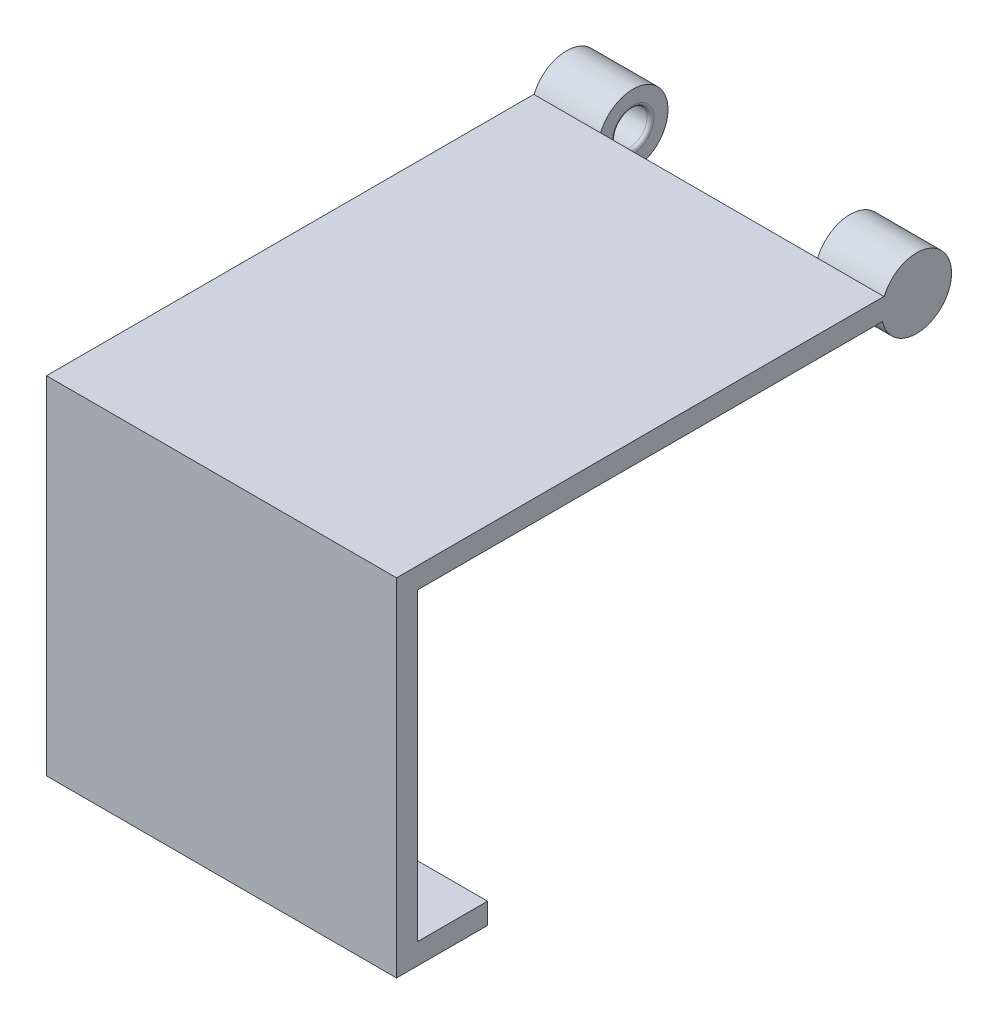
ISO-10303-21;
HEADER;
FILE_DESCRIPTION(('STEP AP214'),'2;1');
FILE_NAME('part.step','',(''),(''),'','','');
FILE_SCHEMA(('AUTOMOTIVE_DESIGN { 1 0 10303 214 1 1 1 1 }'));
ENDSEC;
DATA;
#1=APPLICATION_CONTEXT('core data for automotive mechanical design processes');
#2=APPLICATION_PROTOCOL_DEFINITION('international standard','automotive_design',2000,#1);
#3=PRODUCT_CONTEXT('',#1,'mechanical');
#4=PRODUCT('Part','Part','',(#3));
#5=PRODUCT_RELATED_PRODUCT_CATEGORY('part','',(#4));
#6=PRODUCT_DEFINITION_FORMATION('','',#4);
#7=PRODUCT_DEFINITION_CONTEXT('part definition',#1,'design');
#8=PRODUCT_DEFINITION('design','',#6,#7);
#9=PRODUCT_DEFINITION_SHAPE('','',#8);
#10=(LENGTH_UNIT() NAMED_UNIT(*) SI_UNIT(.MILLI.,.METRE.));
#11=(NAMED_UNIT(*) PLANE_ANGLE_UNIT() SI_UNIT($,.RADIAN.));
#12=(NAMED_UNIT(*) SI_UNIT($,.STERADIAN.) SOLID_ANGLE_UNIT());
#13=UNCERTAINTY_MEASURE_WITH_UNIT(LENGTH_MEASURE(1.E-05),#10,'distance_accuracy_value','');
#14=(GEOMETRIC_REPRESENTATION_CONTEXT(3) GLOBAL_UNCERTAINTY_ASSIGNED_CONTEXT((#13)) GLOBAL_UNIT_ASSIGNED_CONTEXT((#10,
#11,#12)) REPRESENTATION_CONTEXT('',''));
#15=CARTESIAN_POINT('',(0.,0.,0.));
#16=DIRECTION('',(0.,0.,1.));
#17=DIRECTION('',(1.,0.,0.));
#18=AXIS2_PLACEMENT_3D('',#15,#16,#17);
#19=CARTESIAN_POINT('',(9.5,44.5651230044063,-71.2725269870288));
#20=DIRECTION('',(-1.,0.,0.));
#21=DIRECTION('',(0.,0.,-1.));
#22=AXIS2_PLACEMENT_3D('',#19,#20,#21);
#23=PLANE('',#22);
#24=CARTESIAN_POINT('',(9.5,44.5651230044063,-71.2725269870288));
#25=DIRECTION('',(-1.,0.,0.));
#26=DIRECTION('',(0.,0.,1.));
#27=AXIS2_PLACEMENT_3D('',#24,#25,#26);
#28=CIRCLE('',#27,3.00000000000001);
#29=CARTESIAN_POINT('',(9.5,44.5651230044063,-68.2725269870288));
#30=VERTEX_POINT('',#29);
#31=EDGE_CURVE('E41',#30,#30,#28,.T.);
#32=ORIENTED_EDGE('',*,*,#31,.T.);
#33=EDGE_LOOP('',(#32));
#34=FACE_BOUND('',#33,.T.);
#35=DIRECTION('',(0.,-1.,0.));
#36=VECTOR('',#35,1.);
#37=CARTESIAN_POINT('',(9.5,46.5,-66.6));
#38=LINE('',#37,#36);
#39=CARTESIAN_POINT('',(9.5,46.3448678050694,-66.6));
#40=VERTEX_POINT('',#39);
#41=CARTESIAN_POINT('',(9.5,43.5,-66.6));
#42=VERTEX_POINT('',#41);
#43=EDGE_CURVE('E56',#40,#42,#38,.T.);
#44=ORIENTED_EDGE('',*,*,#43,.T.);
#45=DIRECTION('',(0.,0.,1.));
#46=VECTOR('',#45,1.);
#47=CARTESIAN_POINT('',(9.5,43.5,0.));
#48=LINE('',#47,#46);
#49=CARTESIAN_POINT('',(9.5,43.5,-66.3872928078431));
#50=VERTEX_POINT('',#49);
#51=EDGE_CURVE('E150',#42,#50,#48,.T.);
#52=ORIENTED_EDGE('',*,*,#51,.T.);
#53=CARTESIAN_POINT('',(9.5,44.5651230044063,-71.2725269870288));
#54=DIRECTION('',(1.,0.,0.));
#55=DIRECTION('',(0.,0.,-1.));
#56=AXIS2_PLACEMENT_3D('',#53,#54,#55);
#57=CIRCLE('',#56,5.00000000000002);
#58=EDGE_CURVE('E140',#50,#40,#57,.T.);
#59=ORIENTED_EDGE('',*,*,#58,.T.);
#60=EDGE_LOOP('',(#44,#52,#59));
#61=FACE_BOUND('',#60,.T.);
#62=ADVANCED_FACE('F33',(#34,#61),#23,.F.);
#63=CARTESIAN_POINT('',(50.,43.5,0.));
#64=DIRECTION('',(0.,1.,0.));
#65=DIRECTION('',(0.,0.,1.));
#66=AXIS2_PLACEMENT_3D('',#63,#64,#65);
#67=PLANE('',#66);
#68=DIRECTION('',(-1.,0.,0.));
#69=VECTOR('',#68,1.);
#70=CARTESIAN_POINT('',(9.5,43.5,-66.3872928078431));
#71=LINE('',#70,#69);
#72=CARTESIAN_POINT('',(0.,43.5,-66.3872928078431));
#73=VERTEX_POINT('',#72);
#74=EDGE_CURVE('E48',#50,#73,#71,.T.);
#75=ORIENTED_EDGE('',*,*,#74,.F.);
#76=ORIENTED_EDGE('',*,*,#51,.F.);
#77=DIRECTION('',(-1.,0.,0.));
#78=VECTOR('',#77,1.);
#79=CARTESIAN_POINT('',(50.,43.5,-66.6));
#80=LINE('',#79,#78);
#81=CARTESIAN_POINT('',(40.5,43.5,-66.6));
#82=VERTEX_POINT('',#81);
#83=EDGE_CURVE('E213',#82,#42,#80,.T.);
#84=ORIENTED_EDGE('',*,*,#83,.F.);
#85=DIRECTION('',(0.,0.,-1.));
#86=VECTOR('',#85,1.);
#87=CARTESIAN_POINT('',(40.5,43.5,0.));
#88=LINE('',#87,#86);
#89=CARTESIAN_POINT('',(40.5,43.5,-66.3872928078431));
#90=VERTEX_POINT('',#89);
#91=EDGE_CURVE('E166',#90,#82,#88,.T.);
#92=ORIENTED_EDGE('',*,*,#91,.F.);
#93=DIRECTION('',(1.,0.,0.));
#94=VECTOR('',#93,1.);
#95=CARTESIAN_POINT('',(40.5,43.5,-66.3872928078431));
#96=LINE('',#95,#94);
#97=CARTESIAN_POINT('',(50.,43.5,-66.3872928078431));
#98=VERTEX_POINT('',#97);
#99=EDGE_CURVE('E163',#90,#98,#96,.T.);
#100=ORIENTED_EDGE('',*,*,#99,.T.);
#101=DIRECTION('',(0.,0.,-1.));
#102=VECTOR('',#101,1.);
#103=CARTESIAN_POINT('',(50.,43.5,0.));
#104=LINE('',#103,#102);
#105=CARTESIAN_POINT('',(50.,43.5,0.));
#106=VERTEX_POINT('',#105);
#107=EDGE_CURVE('E175',#106,#98,#104,.T.);
#108=ORIENTED_EDGE('',*,*,#107,.F.);
#109=DIRECTION('',(-1.,0.,0.));
#110=VECTOR('',#109,1.);
#111=CARTESIAN_POINT('',(50.,43.5,0.));
#112=LINE('',#111,#110);
#113=CARTESIAN_POINT('',(0.,43.5,0.));
#114=VERTEX_POINT('',#113);
#115=EDGE_CURVE('E215',#106,#114,#112,.T.);
#116=ORIENTED_EDGE('',*,*,#115,.T.);
#117=DIRECTION('',(0.,0.,-1.));
#118=VECTOR('',#117,1.);
#119=CARTESIAN_POINT('',(0.,43.5,0.));
#120=LINE('',#119,#118);
#121=EDGE_CURVE('E133',#114,#73,#120,.T.);
#122=ORIENTED_EDGE('',*,*,#121,.T.);
#123=EDGE_LOOP('',(#75,#76,#84,#92,#100,#108,#116,#122));
#124=FACE_BOUND('',#123,.T.);
#125=ADVANCED_FACE('F245',(#124),#67,.F.);
#126=CARTESIAN_POINT('',(50.,46.5,-66.6));
#127=DIRECTION('',(0.,0.,1.));
#128=DIRECTION('',(1.,0.,0.));
#129=AXIS2_PLACEMENT_3D('',#126,#127,#128);
#130=PLANE('',#129);
#131=DIRECTION('',(-1.,0.,0.));
#132=VECTOR('',#131,1.);
#133=CARTESIAN_POINT('',(9.5,46.3448678050694,-66.6));
#134=LINE('',#133,#132);
#135=CARTESIAN_POINT('',(0.,46.3448678050694,-66.6));
#136=VERTEX_POINT('',#135);
#137=EDGE_CURVE('E135',#136,#40,#134,.F.);
#138=ORIENTED_EDGE('',*,*,#137,.F.);
#139=DIRECTION('',(0.,1.,0.));
#140=VECTOR('',#139,1.);
#141=CARTESIAN_POINT('',(0.,46.5,-66.6));
#142=LINE('',#141,#140);
#143=CARTESIAN_POINT('',(0.,46.5,-66.6));
#144=VERTEX_POINT('',#143);
#145=EDGE_CURVE('E124',#136,#144,#142,.T.);
#146=ORIENTED_EDGE('',*,*,#145,.T.);
#147=DIRECTION('',(-1.,0.,0.));
#148=VECTOR('',#147,1.);
#149=CARTESIAN_POINT('',(50.,46.5,-66.6));
#150=LINE('',#149,#148);
#151=CARTESIAN_POINT('',(50.,46.5,-66.6));
#152=VERTEX_POINT('',#151);
#153=EDGE_CURVE('E211',#152,#144,#150,.T.);
#154=ORIENTED_EDGE('',*,*,#153,.F.);
#155=DIRECTION('',(0.,1.,0.));
#156=VECTOR('',#155,1.);
#157=CARTESIAN_POINT('',(50.,46.5,-66.6));
#158=LINE('',#157,#156);
#159=CARTESIAN_POINT('',(50.,46.3448678050694,-66.6));
#160=VERTEX_POINT('',#159);
#161=EDGE_CURVE('E178',#160,#152,#158,.T.);
#162=ORIENTED_EDGE('',*,*,#161,.F.);
#163=DIRECTION('',(1.,0.,0.));
#164=VECTOR('',#163,1.);
#165=CARTESIAN_POINT('',(40.5,46.3448678050694,-66.6));
#166=LINE('',#165,#164);
#167=CARTESIAN_POINT('',(40.5,46.3448678050694,-66.6));
#168=VERTEX_POINT('',#167);
#169=EDGE_CURVE('E159',#160,#168,#166,.F.);
#170=ORIENTED_EDGE('',*,*,#169,.T.);
#171=DIRECTION('',(0.,1.,0.));
#172=VECTOR('',#171,1.);
#173=CARTESIAN_POINT('',(40.5,46.5,-66.6));
#174=LINE('',#173,#172);
#175=EDGE_CURVE('E221',#82,#168,#174,.T.);
#176=ORIENTED_EDGE('',*,*,#175,.F.);
#177=ORIENTED_EDGE('',*,*,#83,.T.);
#178=ORIENTED_EDGE('',*,*,#43,.F.);
#179=EDGE_LOOP('',(#138,#146,#154,#162,#170,#176,#177,#178));
#180=FACE_BOUND('',#179,.T.);
#181=ADVANCED_FACE('F136',(#180),#130,.F.);
#182=CARTESIAN_POINT('',(50.,0.,0.));
#183=DIRECTION('',(0.,-1.,0.));
#184=DIRECTION('',(0.,0.,-1.));
#185=AXIS2_PLACEMENT_3D('',#182,#183,#184);
#186=PLANE('',#185);
#187=DIRECTION('',(0.,0.,1.));
#188=VECTOR('',#187,1.);
#189=CARTESIAN_POINT('',(0.,0.,0.));
#190=LINE('',#189,#188);
#191=CARTESIAN_POINT('',(0.,0.,-10.));
#192=VERTEX_POINT('',#191);
#193=CARTESIAN_POINT('',(0.,0.,0.));
#194=VERTEX_POINT('',#193);
#195=EDGE_CURVE('E168',#192,#194,#190,.T.);
#196=ORIENTED_EDGE('',*,*,#195,.T.);
#197=DIRECTION('',(-1.,0.,0.));
#198=VECTOR('',#197,1.);
#199=CARTESIAN_POINT('',(50.,0.,0.));
#200=LINE('',#199,#198);
#201=CARTESIAN_POINT('',(50.,0.,0.));
#202=VERTEX_POINT('',#201);
#203=EDGE_CURVE('E218',#202,#194,#200,.T.);
#204=ORIENTED_EDGE('',*,*,#203,.F.);
#205=DIRECTION('',(0.,0.,1.));
#206=VECTOR('',#205,1.);
#207=CARTESIAN_POINT('',(50.,0.,0.));
#208=LINE('',#207,#206);
#209=CARTESIAN_POINT('',(50.,0.,-10.));
#210=VERTEX_POINT('',#209);
#211=EDGE_CURVE('E169',#210,#202,#208,.T.);
#212=ORIENTED_EDGE('',*,*,#211,.F.);
#213=DIRECTION('',(-1.,0.,0.));
#214=VECTOR('',#213,1.);
#215=CARTESIAN_POINT('',(50.,0.,-10.));
#216=LINE('',#215,#214);
#217=EDGE_CURVE('E188',#210,#192,#216,.T.);
#218=ORIENTED_EDGE('',*,*,#217,.T.);
#219=EDGE_LOOP('',(#196,#204,#212,#218));
#220=FACE_BOUND('',#219,.T.);
#221=ADVANCED_FACE('F296',(#220),#186,.F.);
#222=CARTESIAN_POINT('',(50.,0.,0.));
#223=DIRECTION('',(0.,0.,1.));
#224=DIRECTION('',(1.,0.,0.));
#225=AXIS2_PLACEMENT_3D('',#222,#223,#224);
#226=PLANE('',#225);
#227=DIRECTION('',(0.,1.,0.));
#228=VECTOR('',#227,1.);
#229=CARTESIAN_POINT('',(0.,0.,0.));
#230=LINE('',#229,#228);
#231=EDGE_CURVE('E191',#194,#114,#230,.T.);
#232=ORIENTED_EDGE('',*,*,#231,.T.);
#233=ORIENTED_EDGE('',*,*,#115,.F.);
#234=DIRECTION('',(0.,1.,0.));
#235=VECTOR('',#234,1.);
#236=CARTESIAN_POINT('',(50.,0.,0.));
#237=LINE('',#236,#235);
#238=EDGE_CURVE('E172',#202,#106,#237,.T.);
#239=ORIENTED_EDGE('',*,*,#238,.F.);
#240=ORIENTED_EDGE('',*,*,#203,.T.);
#241=EDGE_LOOP('',(#232,#233,#239,#240));
#242=FACE_BOUND('',#241,.T.);
#243=ADVANCED_FACE('F293',(#242),#226,.F.);
#244=CARTESIAN_POINT('',(50.,46.5,3.));
#245=DIRECTION('',(0.,-1.,0.));
#246=DIRECTION('',(0.,0.,-1.));
#247=AXIS2_PLACEMENT_3D('',#244,#245,#246);
#248=PLANE('',#247);
#249=DIRECTION('',(0.,0.,1.));
#250=VECTOR('',#249,1.);
#251=CARTESIAN_POINT('',(0.,46.5,3.));
#252=LINE('',#251,#250);
#253=CARTESIAN_POINT('',(0.,46.5,3.));
#254=VERTEX_POINT('',#253);
#255=EDGE_CURVE('E130',#144,#254,#252,.T.);
#256=ORIENTED_EDGE('',*,*,#255,.T.);
#257=DIRECTION('',(-1.,0.,0.));
#258=VECTOR('',#257,1.);
#259=CARTESIAN_POINT('',(50.,46.5,3.));
#260=LINE('',#259,#258);
#261=CARTESIAN_POINT('',(50.,46.5,3.));
#262=VERTEX_POINT('',#261);
#263=EDGE_CURVE('E208',#262,#254,#260,.T.);
#264=ORIENTED_EDGE('',*,*,#263,.F.);
#265=DIRECTION('',(0.,0.,1.));
#266=VECTOR('',#265,1.);
#267=CARTESIAN_POINT('',(50.,46.5,3.));
#268=LINE('',#267,#266);
#269=EDGE_CURVE('E180',#152,#262,#268,.T.);
#270=ORIENTED_EDGE('',*,*,#269,.F.);
#271=ORIENTED_EDGE('',*,*,#153,.T.);
#272=EDGE_LOOP('',(#256,#264,#270,#271));
#273=FACE_BOUND('',#272,.T.);
#274=ADVANCED_FACE('F289',(#273),#248,.F.);
#275=CARTESIAN_POINT('',(50.,-3.,3.));
#276=DIRECTION('',(0.,0.,-1.));
#277=DIRECTION('',(-1.,0.,0.));
#278=AXIS2_PLACEMENT_3D('',#275,#276,#277);
#279=PLANE('',#278);
#280=DIRECTION('',(0.,-1.,0.));
#281=VECTOR('',#280,1.);
#282=CARTESIAN_POINT('',(0.,-3.,3.));
#283=LINE('',#282,#281);
#284=CARTESIAN_POINT('',(0.,-3.,3.));
#285=VERTEX_POINT('',#284);
#286=EDGE_CURVE('E195',#254,#285,#283,.T.);
#287=ORIENTED_EDGE('',*,*,#286,.T.);
#288=DIRECTION('',(-1.,0.,0.));
#289=VECTOR('',#288,1.);
#290=CARTESIAN_POINT('',(50.,-3.,3.));
#291=LINE('',#290,#289);
#292=CARTESIAN_POINT('',(50.,-3.,3.));
#293=VERTEX_POINT('',#292);
#294=EDGE_CURVE('E205',#293,#285,#291,.T.);
#295=ORIENTED_EDGE('',*,*,#294,.F.);
#296=DIRECTION('',(0.,-1.,0.));
#297=VECTOR('',#296,1.);
#298=CARTESIAN_POINT('',(50.,-3.,3.));
#299=LINE('',#298,#297);
#300=EDGE_CURVE('E182',#262,#293,#299,.T.);
#301=ORIENTED_EDGE('',*,*,#300,.F.);
#302=ORIENTED_EDGE('',*,*,#263,.T.);
#303=EDGE_LOOP('',(#287,#295,#301,#302));
#304=FACE_BOUND('',#303,.T.);
#305=ADVANCED_FACE('F285',(#304),#279,.F.);
#306=CARTESIAN_POINT('',(50.,-3.,3.));
#307=DIRECTION('',(0.,1.,0.));
#308=DIRECTION('',(0.,0.,1.));
#309=AXIS2_PLACEMENT_3D('',#306,#307,#308);
#310=PLANE('',#309);
#311=DIRECTION('',(0.,0.,-1.));
#312=VECTOR('',#311,1.);
#313=CARTESIAN_POINT('',(0.,-3.,3.));
#314=LINE('',#313,#312);
#315=CARTESIAN_POINT('',(0.,-3.,-10.));
#316=VERTEX_POINT('',#315);
#317=EDGE_CURVE('E197',#285,#316,#314,.T.);
#318=ORIENTED_EDGE('',*,*,#317,.T.);
#319=DIRECTION('',(-1.,0.,0.));
#320=VECTOR('',#319,1.);
#321=CARTESIAN_POINT('',(50.,-3.,-10.));
#322=LINE('',#321,#320);
#323=CARTESIAN_POINT('',(50.,-3.,-10.));
#324=VERTEX_POINT('',#323);
#325=EDGE_CURVE('E202',#324,#316,#322,.T.);
#326=ORIENTED_EDGE('',*,*,#325,.F.);
#327=DIRECTION('',(0.,0.,-1.));
#328=VECTOR('',#327,1.);
#329=CARTESIAN_POINT('',(50.,-3.,3.));
#330=LINE('',#329,#328);
#331=EDGE_CURVE('E184',#293,#324,#330,.T.);
#332=ORIENTED_EDGE('',*,*,#331,.F.);
#333=ORIENTED_EDGE('',*,*,#294,.T.);
#334=EDGE_LOOP('',(#318,#326,#332,#333));
#335=FACE_BOUND('',#334,.T.);
#336=ADVANCED_FACE('F281',(#335),#310,.F.);
#337=CARTESIAN_POINT('',(50.,-3.,-10.));
#338=DIRECTION('',(0.,0.,1.));
#339=DIRECTION('',(1.,0.,0.));
#340=AXIS2_PLACEMENT_3D('',#337,#338,#339);
#341=PLANE('',#340);
#342=DIRECTION('',(0.,1.,0.));
#343=VECTOR('',#342,1.);
#344=CARTESIAN_POINT('',(0.,-3.,-10.));
#345=LINE('',#344,#343);
#346=EDGE_CURVE('E173',#316,#192,#345,.T.);
#347=ORIENTED_EDGE('',*,*,#346,.T.);
#348=ORIENTED_EDGE('',*,*,#217,.F.);
#349=DIRECTION('',(0.,1.,0.));
#350=VECTOR('',#349,1.);
#351=CARTESIAN_POINT('',(50.,-3.,-10.));
#352=LINE('',#351,#350);
#353=EDGE_CURVE('E186',#324,#210,#352,.T.);
#354=ORIENTED_EDGE('',*,*,#353,.F.);
#355=ORIENTED_EDGE('',*,*,#325,.T.);
#356=EDGE_LOOP('',(#347,#348,#354,#355));
#357=FACE_BOUND('',#356,.T.);
#358=ADVANCED_FACE('F275',(#357),#341,.F.);
#359=CARTESIAN_POINT('',(50.,0.,0.));
#360=DIRECTION('',(1.,0.,0.));
#361=DIRECTION('',(0.,0.,-1.));
#362=AXIS2_PLACEMENT_3D('',#359,#360,#361);
#363=PLANE('',#362);
#364=ORIENTED_EDGE('',*,*,#107,.T.);
#365=CARTESIAN_POINT('',(50.,44.5651230044063,-71.2725269870288));
#366=DIRECTION('',(1.,0.,0.));
#367=DIRECTION('',(0.,0.,-1.));
#368=AXIS2_PLACEMENT_3D('',#365,#366,#367);
#369=CIRCLE('',#368,5.00000000000002);
#370=EDGE_CURVE('E155',#98,#160,#369,.T.);
#371=ORIENTED_EDGE('',*,*,#370,.T.);
#372=ORIENTED_EDGE('',*,*,#161,.T.);
#373=ORIENTED_EDGE('',*,*,#269,.T.);
#374=ORIENTED_EDGE('',*,*,#300,.T.);
#375=ORIENTED_EDGE('',*,*,#331,.T.);
#376=ORIENTED_EDGE('',*,*,#353,.T.);
#377=ORIENTED_EDGE('',*,*,#211,.T.);
#378=ORIENTED_EDGE('',*,*,#238,.T.);
#379=EDGE_LOOP('',(#364,#371,#372,#373,#374,#375,#376,#377,#378));
#380=FACE_BOUND('',#379,.T.);
#381=ADVANCED_FACE('F272',(#380),#363,.T.);
#382=CARTESIAN_POINT('',(0.,0.,0.));
#383=DIRECTION('',(1.,0.,0.));
#384=DIRECTION('',(0.,0.,-1.));
#385=AXIS2_PLACEMENT_3D('',#382,#383,#384);
#386=PLANE('',#385);
#387=CARTESIAN_POINT('',(0.,44.5651230044063,-71.2725269870288));
#388=DIRECTION('',(1.,0.,0.));
#389=DIRECTION('',(0.,0.,-1.));
#390=AXIS2_PLACEMENT_3D('',#387,#388,#389);
#391=CIRCLE('',#390,5.00000000000002);
#392=EDGE_CURVE('E128',#73,#136,#391,.T.);
#393=ORIENTED_EDGE('',*,*,#392,.F.);
#394=ORIENTED_EDGE('',*,*,#121,.F.);
#395=ORIENTED_EDGE('',*,*,#231,.F.);
#396=ORIENTED_EDGE('',*,*,#195,.F.);
#397=ORIENTED_EDGE('',*,*,#346,.F.);
#398=ORIENTED_EDGE('',*,*,#317,.F.);
#399=ORIENTED_EDGE('',*,*,#286,.F.);
#400=ORIENTED_EDGE('',*,*,#255,.F.);
#401=ORIENTED_EDGE('',*,*,#145,.F.);
#402=EDGE_LOOP('',(#393,#394,#395,#396,#397,#398,#399,#400,#401));
#403=FACE_BOUND('',#402,.T.);
#404=ADVANCED_FACE('F125',(#403),#386,.F.);
#405=CARTESIAN_POINT('',(40.5,44.5651230044063,-71.2725269870288));
#406=DIRECTION('',(1.,0.,0.));
#407=DIRECTION('',(0.,0.,-1.));
#408=AXIS2_PLACEMENT_3D('',#405,#406,#407);
#409=PLANE('',#408);
#410=CARTESIAN_POINT('',(40.5,44.5651230044063,-71.2725269870288));
#411=DIRECTION('',(1.,0.,0.));
#412=DIRECTION('',(0.,0.,-1.));
#413=AXIS2_PLACEMENT_3D('',#410,#411,#412);
#414=CIRCLE('',#413,3.00000000000001);
#415=CARTESIAN_POINT('',(40.5,44.5651230044063,-74.2725269870288));
#416=VERTEX_POINT('',#415);
#417=EDGE_CURVE('E226',#416,#416,#414,.T.);
#418=ORIENTED_EDGE('',*,*,#417,.T.);
#419=EDGE_LOOP('',(#418));
#420=FACE_BOUND('',#419,.T.);
#421=CARTESIAN_POINT('',(40.5,44.5651230044063,-71.2725269870288));
#422=DIRECTION('',(1.,0.,0.));
#423=DIRECTION('',(0.,0.,-1.));
#424=AXIS2_PLACEMENT_3D('',#421,#422,#423);
#425=CIRCLE('',#424,5.00000000000002);
#426=EDGE_CURVE('E156',#90,#168,#425,.T.);
#427=ORIENTED_EDGE('',*,*,#426,.F.);
#428=ORIENTED_EDGE('',*,*,#91,.T.);
#429=ORIENTED_EDGE('',*,*,#175,.T.);
#430=EDGE_LOOP('',(#427,#428,#429));
#431=FACE_BOUND('',#430,.T.);
#432=ADVANCED_FACE('F265',(#420,#431),#409,.F.);
#433=CARTESIAN_POINT('',(40.5,44.5651230044063,-71.2725269870288));
#434=DIRECTION('',(1.,0.,0.));
#435=DIRECTION('',(0.,0.,-1.));
#436=AXIS2_PLACEMENT_3D('',#433,#434,#435);
#437=CYLINDRICAL_SURFACE('',#436,5.00000000000002);
#438=ORIENTED_EDGE('',*,*,#99,.F.);
#439=ORIENTED_EDGE('',*,*,#426,.T.);
#440=ORIENTED_EDGE('',*,*,#169,.F.);
#441=ORIENTED_EDGE('',*,*,#370,.F.);
#442=EDGE_LOOP('',(#438,#439,#440,#441));
#443=FACE_BOUND('',#442,.T.);
#444=ADVANCED_FACE('F263',(#443),#437,.T.);
#445=CARTESIAN_POINT('',(44.5,44.5651230044063,-71.2725269870288));
#446=DIRECTION('',(-1.,0.,0.));
#447=DIRECTION('',(0.,0.,1.));
#448=AXIS2_PLACEMENT_3D('',#445,#446,#447);
#449=CYLINDRICAL_SURFACE('',#448,2.50000000000001);
#450=CARTESIAN_POINT('',(41.,44.5651230044063,-71.2725269870288));
#451=DIRECTION('',(1.,0.,0.));
#452=DIRECTION('',(0.,0.,-1.));
#453=AXIS2_PLACEMENT_3D('',#450,#451,#452);
#454=CIRCLE('',#453,2.50000000000001);
#455=CARTESIAN_POINT('',(41.,44.5651230044063,-73.7725269870289));
#456=VERTEX_POINT('',#455);
#457=EDGE_CURVE('E223',#456,#456,#454,.F.);
#458=ORIENTED_EDGE('',*,*,#457,.T.);
#459=EDGE_LOOP('',(#458));
#460=FACE_BOUND('',#459,.T.);
#461=CARTESIAN_POINT('',(44.5,44.5651230044063,-71.2725269870288));
#462=DIRECTION('',(-1.,0.,0.));
#463=DIRECTION('',(0.,0.,1.));
#464=AXIS2_PLACEMENT_3D('',#461,#462,#463);
#465=CIRCLE('',#464,2.50000000000001);
#466=CARTESIAN_POINT('',(44.5,44.5651230044063,-68.7725269870288));
#467=VERTEX_POINT('',#466);
#468=EDGE_CURVE('E152',#467,#467,#465,.T.);
#469=ORIENTED_EDGE('',*,*,#468,.F.);
#470=EDGE_LOOP('',(#469));
#471=FACE_BOUND('',#470,.T.);
#472=ADVANCED_FACE('F259',(#460,#471),#449,.F.);
#473=CARTESIAN_POINT('',(44.5,44.5651230044063,-71.2725269870288));
#474=DIRECTION('',(-1.,0.,0.));
#475=DIRECTION('',(0.,0.,1.));
#476=AXIS2_PLACEMENT_3D('',#473,#474,#475);
#477=PLANE('',#476);
#478=ORIENTED_EDGE('',*,*,#468,.T.);
#479=EDGE_LOOP('',(#478));
#480=FACE_BOUND('',#479,.T.);
#481=ADVANCED_FACE('F256',(#480),#477,.T.);
#482=CARTESIAN_POINT('',(41.,44.5651230044063,-71.2725269870288));
#483=DIRECTION('',(1.,0.,0.));
#484=DIRECTION('',(0.,0.,-1.));
#485=AXIS2_PLACEMENT_3D('',#482,#483,#484);
#486=TOROIDAL_SURFACE('',#485,3.00000000000001,0.5);
#487=ORIENTED_EDGE('',*,*,#417,.F.);
#488=EDGE_LOOP('',(#487));
#489=FACE_BOUND('',#488,.T.);
#490=ORIENTED_EDGE('',*,*,#457,.F.);
#491=EDGE_LOOP('',(#490));
#492=FACE_BOUND('',#491,.T.);
#493=ADVANCED_FACE('F255',(#489,#492),#486,.T.);
#494=CARTESIAN_POINT('',(9.5,44.5651230044063,-71.2725269870288));
#495=DIRECTION('',(-1.,0.,0.));
#496=DIRECTION('',(0.,0.,1.));
#497=AXIS2_PLACEMENT_3D('',#494,#495,#496);
#498=CYLINDRICAL_SURFACE('',#497,5.00000000000002);
#499=ORIENTED_EDGE('',*,*,#58,.F.);
#500=ORIENTED_EDGE('',*,*,#74,.T.);
#501=ORIENTED_EDGE('',*,*,#392,.T.);
#502=ORIENTED_EDGE('',*,*,#137,.T.);
#503=EDGE_LOOP('',(#499,#500,#501,#502));
#504=FACE_BOUND('',#503,.T.);
#505=ADVANCED_FACE('F142',(#504),#498,.T.);
#506=CARTESIAN_POINT('',(5.5,44.5651230044063,-71.2725269870288));
#507=DIRECTION('',(1.,0.,0.));
#508=DIRECTION('',(0.,0.,-1.));
#509=AXIS2_PLACEMENT_3D('',#506,#507,#508);
#510=CYLINDRICAL_SURFACE('',#509,2.50000000000001);
#511=CARTESIAN_POINT('',(9.,44.5651230044063,-71.2725269870288));
#512=DIRECTION('',(-1.,0.,0.));
#513=DIRECTION('',(0.,0.,1.));
#514=AXIS2_PLACEMENT_3D('',#511,#512,#513);
#515=CIRCLE('',#514,2.50000000000001);
#516=CARTESIAN_POINT('',(9.,44.5651230044063,-68.7725269870288));
#517=VERTEX_POINT('',#516);
#518=EDGE_CURVE('E11',#517,#517,#515,.F.);
#519=ORIENTED_EDGE('',*,*,#518,.T.);
#520=EDGE_LOOP('',(#519));
#521=FACE_BOUND('',#520,.T.);
#522=CARTESIAN_POINT('',(5.5,44.5651230044063,-71.2725269870288));
#523=DIRECTION('',(-1.,0.,0.));
#524=DIRECTION('',(0.,0.,1.));
#525=AXIS2_PLACEMENT_3D('',#522,#523,#524);
#526=CIRCLE('',#525,2.50000000000001);
#527=CARTESIAN_POINT('',(5.5,44.5651230044063,-68.7725269870288));
#528=VERTEX_POINT('',#527);
#529=EDGE_CURVE('E143',#528,#528,#526,.T.);
#530=ORIENTED_EDGE('',*,*,#529,.T.);
#531=EDGE_LOOP('',(#530));
#532=FACE_BOUND('',#531,.T.);
#533=ADVANCED_FACE('F240',(#521,#532),#510,.F.);
#534=CARTESIAN_POINT('',(5.5,44.5651230044063,-71.2725269870288));
#535=DIRECTION('',(1.,0.,0.));
#536=DIRECTION('',(0.,0.,1.));
#537=AXIS2_PLACEMENT_3D('',#534,#535,#536);
#538=PLANE('',#537);
#539=ORIENTED_EDGE('',*,*,#529,.F.);
#540=EDGE_LOOP('',(#539));
#541=FACE_BOUND('',#540,.T.);
#542=ADVANCED_FACE('F235',(#541),#538,.T.);
#543=CARTESIAN_POINT('',(9.,44.5651230044063,-71.2725269870288));
#544=DIRECTION('',(-1.,0.,0.));
#545=DIRECTION('',(0.,0.,1.));
#546=AXIS2_PLACEMENT_3D('',#543,#544,#545);
#547=TOROIDAL_SURFACE('',#546,3.00000000000001,0.5);
#548=ORIENTED_EDGE('',*,*,#518,.F.);
#549=EDGE_LOOP('',(#548));
#550=FACE_BOUND('',#549,.T.);
#551=ORIENTED_EDGE('',*,*,#31,.F.);
#552=EDGE_LOOP('',(#551));
#553=FACE_BOUND('',#552,.T.);
#554=ADVANCED_FACE('F35',(#550,#553),#547,.T.);
#555=CLOSED_SHELL('',(#62,#125,#181,#221,#243,#274,#305,#336,#358,#381,#404,#432,#444,#472,#481,
#493,#505,#533,#542,#554));
#556=MANIFOLD_SOLID_BREP('B2',#555);
#557=ADVANCED_BREP_SHAPE_REPRESENTATION('',(#18,#556),#14);
#558=SHAPE_DEFINITION_REPRESENTATION(#9,#557);
ENDSEC;
END-ISO-10303-21;
